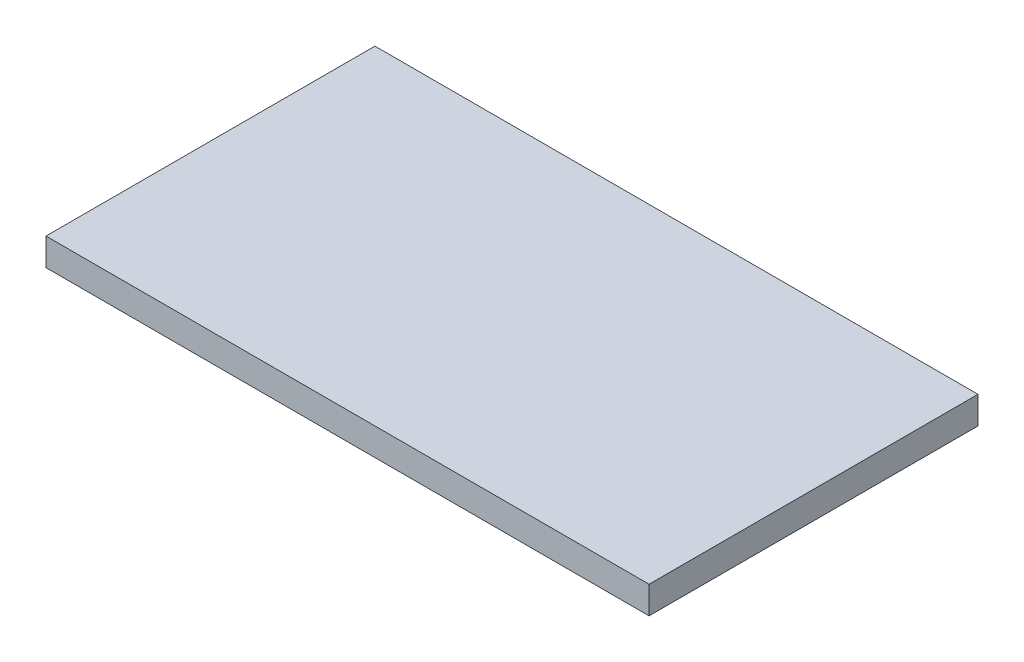
ISO-10303-21;
HEADER;
FILE_DESCRIPTION(('STEP AP214'),'2;1');
FILE_NAME('part.step','',(''),(''),'','','');
FILE_SCHEMA(('AUTOMOTIVE_DESIGN { 1 0 10303 214 1 1 1 1 }'));
ENDSEC;
DATA;
#1=APPLICATION_CONTEXT('core data for automotive mechanical design processes');
#2=APPLICATION_PROTOCOL_DEFINITION('international standard','automotive_design',2000,#1);
#3=PRODUCT_CONTEXT('',#1,'mechanical');
#4=PRODUCT('Part','Part','',(#3));
#5=PRODUCT_RELATED_PRODUCT_CATEGORY('part','',(#4));
#6=PRODUCT_DEFINITION_FORMATION('','',#4);
#7=PRODUCT_DEFINITION_CONTEXT('part definition',#1,'design');
#8=PRODUCT_DEFINITION('design','',#6,#7);
#9=PRODUCT_DEFINITION_SHAPE('','',#8);
#10=(LENGTH_UNIT() NAMED_UNIT(*) SI_UNIT(.MILLI.,.METRE.));
#11=(NAMED_UNIT(*) PLANE_ANGLE_UNIT() SI_UNIT($,.RADIAN.));
#12=(NAMED_UNIT(*) SI_UNIT($,.STERADIAN.) SOLID_ANGLE_UNIT());
#13=UNCERTAINTY_MEASURE_WITH_UNIT(LENGTH_MEASURE(1.E-05),#10,'distance_accuracy_value','');
#14=(GEOMETRIC_REPRESENTATION_CONTEXT(3) GLOBAL_UNCERTAINTY_ASSIGNED_CONTEXT((#13)) GLOBAL_UNIT_ASSIGNED_CONTEXT((#10,
#11,#12)) REPRESENTATION_CONTEXT('',''));
#15=CARTESIAN_POINT('',(0.,0.,0.));
#16=DIRECTION('',(0.,0.,1.));
#17=DIRECTION('',(1.,0.,0.));
#18=AXIS2_PLACEMENT_3D('',#15,#16,#17);
#19=CARTESIAN_POINT('',(-22.,1.,0.));
#20=DIRECTION('',(0.,0.,-1.));
#21=DIRECTION('',(-1.,0.,0.));
#22=AXIS2_PLACEMENT_3D('',#19,#20,#21);
#23=PLANE('',#22);
#24=DIRECTION('',(1.,0.,0.));
#25=VECTOR('',#24,1.);
#26=CARTESIAN_POINT('',(-22.,0.,0.));
#27=LINE('',#26,#25);
#28=CARTESIAN_POINT('',(-22.,0.,0.));
#29=VERTEX_POINT('',#28);
#30=CARTESIAN_POINT('',(0.,0.,0.));
#31=VERTEX_POINT('',#30);
#32=EDGE_CURVE('E96',#29,#31,#27,.T.);
#33=ORIENTED_EDGE('',*,*,#32,.T.);
#34=DIRECTION('',(0.,-1.,0.));
#35=VECTOR('',#34,1.);
#36=CARTESIAN_POINT('',(0.,1.,0.));
#37=LINE('',#36,#35);
#38=CARTESIAN_POINT('',(0.,1.,0.));
#39=VERTEX_POINT('',#38);
#40=EDGE_CURVE('E11',#39,#31,#37,.T.);
#41=ORIENTED_EDGE('',*,*,#40,.F.);
#42=DIRECTION('',(1.,0.,0.));
#43=VECTOR('',#42,1.);
#44=CARTESIAN_POINT('',(-22.,1.,0.));
#45=LINE('',#44,#43);
#46=CARTESIAN_POINT('',(-22.,1.,0.));
#47=VERTEX_POINT('',#46);
#48=EDGE_CURVE('E73',#47,#39,#45,.T.);
#49=ORIENTED_EDGE('',*,*,#48,.F.);
#50=DIRECTION('',(0.,-1.,0.));
#51=VECTOR('',#50,1.);
#52=CARTESIAN_POINT('',(-22.,1.,0.));
#53=LINE('',#52,#51);
#54=EDGE_CURVE('E92',#47,#29,#53,.T.);
#55=ORIENTED_EDGE('',*,*,#54,.T.);
#56=EDGE_LOOP('',(#33,#41,#49,#55));
#57=FACE_BOUND('',#56,.T.);
#58=ADVANCED_FACE('F34',(#57),#23,.F.);
#59=CARTESIAN_POINT('',(0.,1.,-12.));
#60=DIRECTION('',(1.,0.,0.));
#61=DIRECTION('',(0.,0.,-1.));
#62=AXIS2_PLACEMENT_3D('',#59,#60,#61);
#63=PLANE('',#62);
#64=DIRECTION('',(0.,0.,1.));
#65=VECTOR('',#64,1.);
#66=CARTESIAN_POINT('',(0.,0.,-12.));
#67=LINE('',#66,#65);
#68=CARTESIAN_POINT('',(0.,0.,-12.));
#69=VERTEX_POINT('',#68);
#70=EDGE_CURVE('E82',#69,#31,#67,.T.);
#71=ORIENTED_EDGE('',*,*,#70,.F.);
#72=DIRECTION('',(0.,-1.,0.));
#73=VECTOR('',#72,1.);
#74=CARTESIAN_POINT('',(0.,1.,-12.));
#75=LINE('',#74,#73);
#76=CARTESIAN_POINT('',(0.,1.,-12.));
#77=VERTEX_POINT('',#76);
#78=EDGE_CURVE('E42',#77,#69,#75,.T.);
#79=ORIENTED_EDGE('',*,*,#78,.F.);
#80=DIRECTION('',(0.,0.,1.));
#81=VECTOR('',#80,1.);
#82=CARTESIAN_POINT('',(0.,1.,-12.));
#83=LINE('',#82,#81);
#84=EDGE_CURVE('E80',#77,#39,#83,.T.);
#85=ORIENTED_EDGE('',*,*,#84,.T.);
#86=ORIENTED_EDGE('',*,*,#40,.T.);
#87=EDGE_LOOP('',(#71,#79,#85,#86));
#88=FACE_BOUND('',#87,.T.);
#89=ADVANCED_FACE('F79',(#88),#63,.T.);
#90=CARTESIAN_POINT('',(-22.,1.,-12.));
#91=DIRECTION('',(0.,0.,-1.));
#92=DIRECTION('',(-1.,0.,0.));
#93=AXIS2_PLACEMENT_3D('',#90,#91,#92);
#94=PLANE('',#93);
#95=DIRECTION('',(1.,0.,0.));
#96=VECTOR('',#95,1.);
#97=CARTESIAN_POINT('',(-22.,0.,-12.));
#98=LINE('',#97,#96);
#99=CARTESIAN_POINT('',(-22.,0.,-12.));
#100=VERTEX_POINT('',#99);
#101=EDGE_CURVE('E100',#100,#69,#98,.T.);
#102=ORIENTED_EDGE('',*,*,#101,.F.);
#103=DIRECTION('',(0.,-1.,0.));
#104=VECTOR('',#103,1.);
#105=CARTESIAN_POINT('',(-22.,1.,-12.));
#106=LINE('',#105,#104);
#107=CARTESIAN_POINT('',(-22.,1.,-12.));
#108=VERTEX_POINT('',#107);
#109=EDGE_CURVE('E65',#108,#100,#106,.T.);
#110=ORIENTED_EDGE('',*,*,#109,.F.);
#111=DIRECTION('',(1.,0.,0.));
#112=VECTOR('',#111,1.);
#113=CARTESIAN_POINT('',(-22.,1.,-12.));
#114=LINE('',#113,#112);
#115=EDGE_CURVE('E88',#108,#77,#114,.T.);
#116=ORIENTED_EDGE('',*,*,#115,.T.);
#117=ORIENTED_EDGE('',*,*,#78,.T.);
#118=EDGE_LOOP('',(#102,#110,#116,#117));
#119=FACE_BOUND('',#118,.T.);
#120=ADVANCED_FACE('F90',(#119),#94,.T.);
#121=CARTESIAN_POINT('',(-22.,1.,-12.));
#122=DIRECTION('',(1.,0.,0.));
#123=DIRECTION('',(0.,0.,-1.));
#124=AXIS2_PLACEMENT_3D('',#121,#122,#123);
#125=PLANE('',#124);
#126=DIRECTION('',(0.,0.,1.));
#127=VECTOR('',#126,1.);
#128=CARTESIAN_POINT('',(-22.,0.,-12.));
#129=LINE('',#128,#127);
#130=EDGE_CURVE('E68',#100,#29,#129,.T.);
#131=ORIENTED_EDGE('',*,*,#130,.T.);
#132=ORIENTED_EDGE('',*,*,#54,.F.);
#133=DIRECTION('',(0.,0.,1.));
#134=VECTOR('',#133,1.);
#135=CARTESIAN_POINT('',(-22.,1.,-12.));
#136=LINE('',#135,#134);
#137=EDGE_CURVE('E50',#108,#47,#136,.T.);
#138=ORIENTED_EDGE('',*,*,#137,.F.);
#139=ORIENTED_EDGE('',*,*,#109,.T.);
#140=EDGE_LOOP('',(#131,#132,#138,#139));
#141=FACE_BOUND('',#140,.T.);
#142=ADVANCED_FACE('F113',(#141),#125,.F.);
#143=CARTESIAN_POINT('',(0.,1.,0.));
#144=DIRECTION('',(0.,-1.,0.));
#145=DIRECTION('',(0.,0.,-1.));
#146=AXIS2_PLACEMENT_3D('',#143,#144,#145);
#147=PLANE('',#146);
#148=ORIENTED_EDGE('',*,*,#48,.T.);
#149=ORIENTED_EDGE('',*,*,#84,.F.);
#150=ORIENTED_EDGE('',*,*,#115,.F.);
#151=ORIENTED_EDGE('',*,*,#137,.T.);
#152=EDGE_LOOP('',(#148,#149,#150,#151));
#153=FACE_BOUND('',#152,.T.);
#154=ADVANCED_FACE('F87',(#153),#147,.F.);
#155=CARTESIAN_POINT('',(0.,0.,0.));
#156=DIRECTION('',(0.,-1.,0.));
#157=DIRECTION('',(0.,0.,-1.));
#158=AXIS2_PLACEMENT_3D('',#155,#156,#157);
#159=PLANE('',#158);
#160=ORIENTED_EDGE('',*,*,#32,.F.);
#161=ORIENTED_EDGE('',*,*,#130,.F.);
#162=ORIENTED_EDGE('',*,*,#101,.T.);
#163=ORIENTED_EDGE('',*,*,#70,.T.);
#164=EDGE_LOOP('',(#160,#161,#162,#163));
#165=FACE_BOUND('',#164,.T.);
#166=ADVANCED_FACE('F107',(#165),#159,.T.);
#167=CLOSED_SHELL('',(#58,#89,#120,#142,#154,#166));
#168=MANIFOLD_SOLID_BREP('B2',#167);
#169=ADVANCED_BREP_SHAPE_REPRESENTATION('',(#18,#168),#14);
#170=SHAPE_DEFINITION_REPRESENTATION(#9,#169);
ENDSEC;
END-ISO-10303-21;
